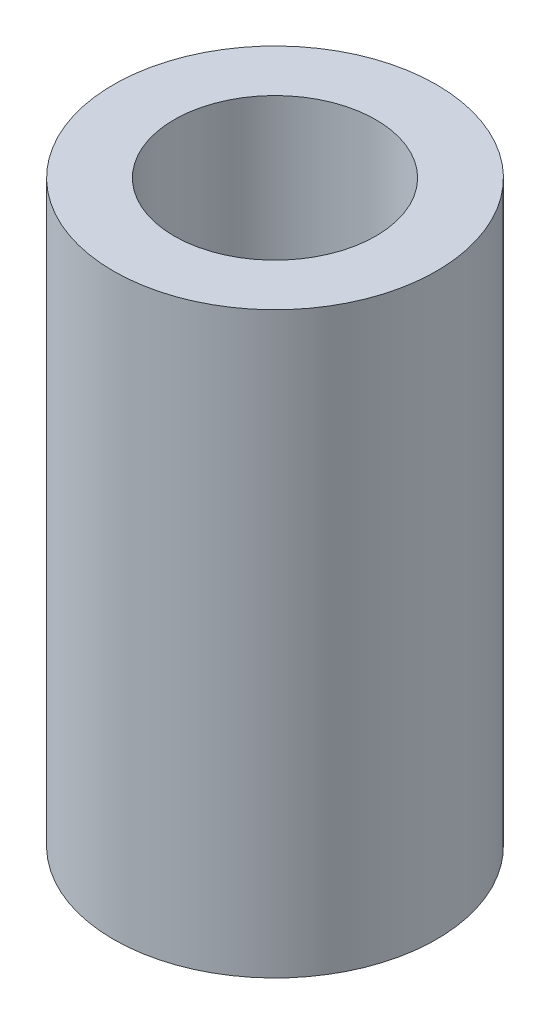
ISO-10303-21;
HEADER;
FILE_DESCRIPTION(('STEP AP214'),'2;1');
FILE_NAME('part.step','',(''),(''),'','','');
FILE_SCHEMA(('AUTOMOTIVE_DESIGN { 1 0 10303 214 1 1 1 1 }'));
ENDSEC;
DATA;
#1=APPLICATION_CONTEXT('core data for automotive mechanical design processes');
#2=APPLICATION_PROTOCOL_DEFINITION('international standard','automotive_design',2000,#1);
#3=PRODUCT_CONTEXT('',#1,'mechanical');
#4=PRODUCT('Part','Part','',(#3));
#5=PRODUCT_RELATED_PRODUCT_CATEGORY('part','',(#4));
#6=PRODUCT_DEFINITION_FORMATION('','',#4);
#7=PRODUCT_DEFINITION_CONTEXT('part definition',#1,'design');
#8=PRODUCT_DEFINITION('design','',#6,#7);
#9=PRODUCT_DEFINITION_SHAPE('','',#8);
#10=(LENGTH_UNIT() NAMED_UNIT(*) SI_UNIT(.MILLI.,.METRE.));
#11=(NAMED_UNIT(*) PLANE_ANGLE_UNIT() SI_UNIT($,.RADIAN.));
#12=(NAMED_UNIT(*) SI_UNIT($,.STERADIAN.) SOLID_ANGLE_UNIT());
#13=UNCERTAINTY_MEASURE_WITH_UNIT(LENGTH_MEASURE(1.E-05),#10,'distance_accuracy_value','');
#14=(GEOMETRIC_REPRESENTATION_CONTEXT(3) GLOBAL_UNCERTAINTY_ASSIGNED_CONTEXT((#13)) GLOBAL_UNIT_ASSIGNED_CONTEXT((#10,
#11,#12)) REPRESENTATION_CONTEXT('',''));
#15=CARTESIAN_POINT('',(0.,0.,0.));
#16=DIRECTION('',(0.,0.,1.));
#17=DIRECTION('',(1.,0.,0.));
#18=AXIS2_PLACEMENT_3D('',#15,#16,#17);
#19=CARTESIAN_POINT('',(0.,71.654799573542,0.));
#20=DIRECTION('',(0.,-1.,0.));
#21=DIRECTION('',(0.,0.,-1.));
#22=AXIS2_PLACEMENT_3D('',#19,#20,#21);
#23=CYLINDRICAL_SURFACE('',#22,20.);
#24=CARTESIAN_POINT('',(0.,71.654799573542,0.));
#25=DIRECTION('',(0.,1.,0.));
#26=DIRECTION('',(0.,0.,1.));
#27=AXIS2_PLACEMENT_3D('',#24,#25,#26);
#28=CIRCLE('',#27,20.);
#29=CARTESIAN_POINT('',(0.,71.654799573542,20.));
#30=VERTEX_POINT('',#29);
#31=EDGE_CURVE('E10',#30,#30,#28,.T.);
#32=ORIENTED_EDGE('',*,*,#31,.F.);
#33=EDGE_LOOP('',(#32));
#34=FACE_BOUND('',#33,.T.);
#35=CARTESIAN_POINT('',(0.,0.,0.));
#36=DIRECTION('',(0.,1.,0.));
#37=DIRECTION('',(0.,0.,1.));
#38=AXIS2_PLACEMENT_3D('',#35,#36,#37);
#39=CIRCLE('',#38,20.);
#40=CARTESIAN_POINT('',(0.,0.,20.));
#41=VERTEX_POINT('',#40);
#42=EDGE_CURVE('E37',#41,#41,#39,.T.);
#43=ORIENTED_EDGE('',*,*,#42,.T.);
#44=EDGE_LOOP('',(#43));
#45=FACE_BOUND('',#44,.T.);
#46=ADVANCED_FACE('F40',(#34,#45),#23,.T.);
#47=CARTESIAN_POINT('',(0.,71.654799573542,0.));
#48=DIRECTION('',(0.,1.,0.));
#49=DIRECTION('',(0.,0.,1.));
#50=AXIS2_PLACEMENT_3D('',#47,#48,#49);
#51=PLANE('',#50);
#52=CARTESIAN_POINT('',(0.,71.654799573542,0.));
#53=DIRECTION('',(0.,1.,0.));
#54=DIRECTION('',(0.,0.,1.));
#55=AXIS2_PLACEMENT_3D('',#52,#53,#54);
#56=CIRCLE('',#55,12.4874910969046);
#57=CARTESIAN_POINT('',(0.,71.654799573542,12.4874910969046));
#58=VERTEX_POINT('',#57);
#59=EDGE_CURVE('E50',#58,#58,#56,.T.);
#60=ORIENTED_EDGE('',*,*,#59,.F.);
#61=EDGE_LOOP('',(#60));
#62=FACE_BOUND('',#61,.T.);
#63=ORIENTED_EDGE('',*,*,#31,.T.);
#64=EDGE_LOOP('',(#63));
#65=FACE_BOUND('',#64,.T.);
#66=ADVANCED_FACE('F59',(#62,#65),#51,.T.);
#67=CARTESIAN_POINT('',(0.,0.,0.));
#68=DIRECTION('',(0.,1.,0.));
#69=DIRECTION('',(0.,0.,1.));
#70=AXIS2_PLACEMENT_3D('',#67,#68,#69);
#71=PLANE('',#70);
#72=CARTESIAN_POINT('',(0.,0.,0.));
#73=DIRECTION('',(0.,1.,0.));
#74=DIRECTION('',(0.,0.,1.));
#75=AXIS2_PLACEMENT_3D('',#72,#73,#74);
#76=CIRCLE('',#75,12.4874910969046);
#77=CARTESIAN_POINT('',(0.,0.,12.4874910969046));
#78=VERTEX_POINT('',#77);
#79=EDGE_CURVE('E47',#78,#78,#76,.T.);
#80=ORIENTED_EDGE('',*,*,#79,.T.);
#81=EDGE_LOOP('',(#80));
#82=FACE_BOUND('',#81,.T.);
#83=ORIENTED_EDGE('',*,*,#42,.F.);
#84=EDGE_LOOP('',(#83));
#85=FACE_BOUND('',#84,.T.);
#86=ADVANCED_FACE('F58',(#82,#85),#71,.F.);
#87=CARTESIAN_POINT('',(0.,71.654799573542,0.));
#88=DIRECTION('',(0.,-1.,0.));
#89=DIRECTION('',(0.,0.,-1.));
#90=AXIS2_PLACEMENT_3D('',#87,#88,#89);
#91=CYLINDRICAL_SURFACE('',#90,12.4874910969046);
#92=ORIENTED_EDGE('',*,*,#59,.T.);
#93=EDGE_LOOP('',(#92));
#94=FACE_BOUND('',#93,.T.);
#95=ORIENTED_EDGE('',*,*,#79,.F.);
#96=EDGE_LOOP('',(#95));
#97=FACE_BOUND('',#96,.T.);
#98=ADVANCED_FACE('F54',(#94,#97),#91,.F.);
#99=CLOSED_SHELL('',(#46,#66,#86,#98));
#100=MANIFOLD_SOLID_BREP('B2',#99);
#101=ADVANCED_BREP_SHAPE_REPRESENTATION('',(#18,#100),#14);
#102=SHAPE_DEFINITION_REPRESENTATION(#9,#101);
ENDSEC;
END-ISO-10303-21;
